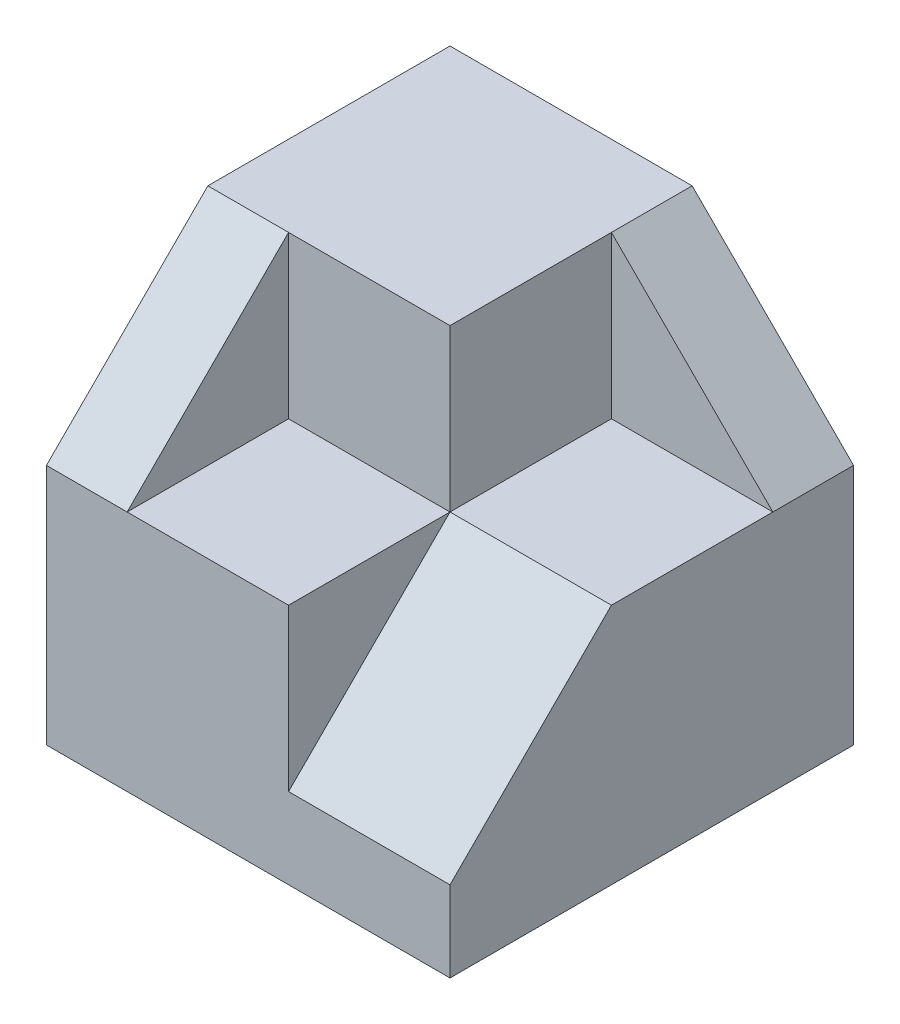
ISO-10303-21;
HEADER;
FILE_DESCRIPTION(('STEP AP214'),'2;1');
FILE_NAME('part.step','',(''),(''),'','','');
FILE_SCHEMA(('AUTOMOTIVE_DESIGN { 1 0 10303 214 1 1 1 1 }'));
ENDSEC;
DATA;
#1=APPLICATION_CONTEXT('core data for automotive mechanical design processes');
#2=APPLICATION_PROTOCOL_DEFINITION('international standard','automotive_design',2000,#1);
#3=PRODUCT_CONTEXT('',#1,'mechanical');
#4=PRODUCT('Part','Part','',(#3));
#5=PRODUCT_RELATED_PRODUCT_CATEGORY('part','',(#4));
#6=PRODUCT_DEFINITION_FORMATION('','',#4);
#7=PRODUCT_DEFINITION_CONTEXT('part definition',#1,'design');
#8=PRODUCT_DEFINITION('design','',#6,#7);
#9=PRODUCT_DEFINITION_SHAPE('','',#8);
#10=(LENGTH_UNIT() NAMED_UNIT(*) SI_UNIT(.MILLI.,.METRE.));
#11=(NAMED_UNIT(*) PLANE_ANGLE_UNIT() SI_UNIT($,.RADIAN.));
#12=(NAMED_UNIT(*) SI_UNIT($,.STERADIAN.) SOLID_ANGLE_UNIT());
#13=UNCERTAINTY_MEASURE_WITH_UNIT(LENGTH_MEASURE(1.E-05),#10,'distance_accuracy_value','');
#14=(GEOMETRIC_REPRESENTATION_CONTEXT(3) GLOBAL_UNCERTAINTY_ASSIGNED_CONTEXT((#13)) GLOBAL_UNIT_ASSIGNED_CONTEXT((#10,
#11,#12)) REPRESENTATION_CONTEXT('',''));
#15=CARTESIAN_POINT('',(0.,0.,0.));
#16=DIRECTION('',(0.,0.,1.));
#17=DIRECTION('',(1.,0.,0.));
#18=AXIS2_PLACEMENT_3D('',#15,#16,#17);
#19=CARTESIAN_POINT('',(0.,0.5,0.));
#20=DIRECTION('',(0.,-1.,0.));
#21=DIRECTION('',(0.,0.,-1.));
#22=AXIS2_PLACEMENT_3D('',#19,#20,#21);
#23=PLANE('',#22);
#24=DIRECTION('',(0.,0.,1.));
#25=VECTOR('',#24,1.);
#26=CARTESIAN_POINT('',(0.5,0.5,1.));
#27=LINE('',#26,#25);
#28=CARTESIAN_POINT('',(0.5,0.5,1.));
#29=VERTEX_POINT('',#28);
#30=CARTESIAN_POINT('',(0.5,0.5,3.));
#31=VERTEX_POINT('',#30);
#32=EDGE_CURVE('E193',#29,#31,#27,.T.);
#33=ORIENTED_EDGE('',*,*,#32,.T.);
#34=DIRECTION('',(1.,0.,0.));
#35=VECTOR('',#34,1.);
#36=CARTESIAN_POINT('',(0.5,0.5,3.));
#37=LINE('',#36,#35);
#38=CARTESIAN_POINT('',(2.5,0.5,3.));
#39=VERTEX_POINT('',#38);
#40=EDGE_CURVE('E176',#31,#39,#37,.T.);
#41=ORIENTED_EDGE('',*,*,#40,.T.);
#42=DIRECTION('',(0.,0.,-1.));
#43=VECTOR('',#42,1.);
#44=CARTESIAN_POINT('',(2.5,0.5,3.));
#45=LINE('',#44,#43);
#46=CARTESIAN_POINT('',(2.5,0.5,1.));
#47=VERTEX_POINT('',#46);
#48=EDGE_CURVE('E204',#39,#47,#45,.T.);
#49=ORIENTED_EDGE('',*,*,#48,.T.);
#50=DIRECTION('',(-1.,0.,0.));
#51=VECTOR('',#50,1.);
#52=CARTESIAN_POINT('',(2.5,0.5,1.));
#53=LINE('',#52,#51);
#54=EDGE_CURVE('E190',#47,#29,#53,.T.);
#55=ORIENTED_EDGE('',*,*,#54,.T.);
#56=EDGE_LOOP('',(#33,#41,#49,#55));
#57=FACE_BOUND('',#56,.T.);
#58=ADVANCED_FACE('F33',(#57),#23,.F.);
#59=CARTESIAN_POINT('',(2.5,-2.5,5.));
#60=DIRECTION('',(-1.,0.,0.));
#61=DIRECTION('',(0.,0.,1.));
#62=AXIS2_PLACEMENT_3D('',#59,#60,#61);
#63=PLANE('',#62);
#64=ORIENTED_EDGE('',*,*,#48,.F.);
#65=DIRECTION('',(0.,0.707106781186548,-0.707106781186548));
#66=VECTOR('',#65,1.);
#67=CARTESIAN_POINT('',(2.5,0.5,3.));
#68=LINE('',#67,#66);
#69=CARTESIAN_POINT('',(2.5,-1.5,5.));
#70=VERTEX_POINT('',#69);
#71=EDGE_CURVE('E170',#70,#39,#68,.T.);
#72=ORIENTED_EDGE('',*,*,#71,.F.);
#73=DIRECTION('',(0.,1.,0.));
#74=VECTOR('',#73,1.);
#75=CARTESIAN_POINT('',(2.5,-2.5,5.));
#76=LINE('',#75,#74);
#77=CARTESIAN_POINT('',(2.5,-2.5,5.));
#78=VERTEX_POINT('',#77);
#79=EDGE_CURVE('E132',#78,#70,#76,.T.);
#80=ORIENTED_EDGE('',*,*,#79,.F.);
#81=DIRECTION('',(0.,0.,-1.));
#82=VECTOR('',#81,1.);
#83=CARTESIAN_POINT('',(2.5,-2.5,5.));
#84=LINE('',#83,#82);
#85=CARTESIAN_POINT('',(2.5,-2.5,0.));
#86=VERTEX_POINT('',#85);
#87=EDGE_CURVE('E134',#78,#86,#84,.T.);
#88=ORIENTED_EDGE('',*,*,#87,.T.);
#89=DIRECTION('',(0.,1.,0.));
#90=VECTOR('',#89,1.);
#91=CARTESIAN_POINT('',(2.5,-2.5,0.));
#92=LINE('',#91,#90);
#93=CARTESIAN_POINT('',(2.5,0.5,0.));
#94=VERTEX_POINT('',#93);
#95=EDGE_CURVE('E141',#86,#94,#92,.T.);
#96=ORIENTED_EDGE('',*,*,#95,.T.);
#97=DIRECTION('',(0.,0.,1.));
#98=VECTOR('',#97,1.);
#99=CARTESIAN_POINT('',(2.5,0.5,0.));
#100=LINE('',#99,#98);
#101=EDGE_CURVE('E166',#94,#47,#100,.T.);
#102=ORIENTED_EDGE('',*,*,#101,.T.);
#103=EDGE_LOOP('',(#64,#72,#80,#88,#96,#102));
#104=FACE_BOUND('',#103,.T.);
#105=ADVANCED_FACE('F35',(#104),#63,.F.);
#106=CARTESIAN_POINT('',(-2.5,2.5,5.));
#107=DIRECTION('',(0.,-1.,0.));
#108=DIRECTION('',(0.,0.,-1.));
#109=AXIS2_PLACEMENT_3D('',#106,#107,#108);
#110=PLANE('',#109);
#111=DIRECTION('',(0.,0.,-1.));
#112=VECTOR('',#111,1.);
#113=CARTESIAN_POINT('',(-2.5,2.5,5.));
#114=LINE('',#113,#112);
#115=CARTESIAN_POINT('',(-2.5,2.5,3.));
#116=VERTEX_POINT('',#115);
#117=CARTESIAN_POINT('',(-2.5,2.5,0.));
#118=VERTEX_POINT('',#117);
#119=EDGE_CURVE('E11',#116,#118,#114,.T.);
#120=ORIENTED_EDGE('',*,*,#119,.F.);
#121=DIRECTION('',(1.,0.,0.));
#122=VECTOR('',#121,1.);
#123=CARTESIAN_POINT('',(-2.5,2.5,3.));
#124=LINE('',#123,#122);
#125=CARTESIAN_POINT('',(-1.5,2.5,3.));
#126=VERTEX_POINT('',#125);
#127=EDGE_CURVE('E113',#116,#126,#124,.T.);
#128=ORIENTED_EDGE('',*,*,#127,.T.);
#129=DIRECTION('',(-1.,0.,0.));
#130=VECTOR('',#129,1.);
#131=CARTESIAN_POINT('',(-1.5,2.5,3.));
#132=LINE('',#131,#130);
#133=CARTESIAN_POINT('',(0.5,2.5,3.));
#134=VERTEX_POINT('',#133);
#135=EDGE_CURVE('E201',#134,#126,#132,.T.);
#136=ORIENTED_EDGE('',*,*,#135,.F.);
#137=DIRECTION('',(0.,0.,1.));
#138=VECTOR('',#137,1.);
#139=CARTESIAN_POINT('',(0.5,2.5,1.));
#140=LINE('',#139,#138);
#141=CARTESIAN_POINT('',(0.5,2.5,1.));
#142=VERTEX_POINT('',#141);
#143=EDGE_CURVE('E188',#142,#134,#140,.T.);
#144=ORIENTED_EDGE('',*,*,#143,.F.);
#145=DIRECTION('',(0.,0.,1.));
#146=VECTOR('',#145,1.);
#147=CARTESIAN_POINT('',(0.5,2.5,0.));
#148=LINE('',#147,#146);
#149=CARTESIAN_POINT('',(0.5,2.5,0.));
#150=VERTEX_POINT('',#149);
#151=EDGE_CURVE('E185',#150,#142,#148,.T.);
#152=ORIENTED_EDGE('',*,*,#151,.F.);
#153=DIRECTION('',(-1.,0.,0.));
#154=VECTOR('',#153,1.);
#155=CARTESIAN_POINT('',(-2.5,2.5,0.));
#156=LINE('',#155,#154);
#157=EDGE_CURVE('E144',#150,#118,#156,.T.);
#158=ORIENTED_EDGE('',*,*,#157,.T.);
#159=EDGE_LOOP('',(#120,#128,#136,#144,#152,#158));
#160=FACE_BOUND('',#159,.T.);
#161=ADVANCED_FACE('F225',(#160),#110,.F.);
#162=CARTESIAN_POINT('',(-2.5,-2.5,5.));
#163=DIRECTION('',(1.,0.,0.));
#164=DIRECTION('',(0.,0.,-1.));
#165=AXIS2_PLACEMENT_3D('',#162,#163,#164);
#166=PLANE('',#165);
#167=DIRECTION('',(0.,-1.,0.));
#168=VECTOR('',#167,1.);
#169=CARTESIAN_POINT('',(-2.5,-2.5,5.));
#170=LINE('',#169,#168);
#171=CARTESIAN_POINT('',(-2.5,0.5,5.));
#172=VERTEX_POINT('',#171);
#173=CARTESIAN_POINT('',(-2.5,-2.5,5.));
#174=VERTEX_POINT('',#173);
#175=EDGE_CURVE('E122',#172,#174,#170,.T.);
#176=ORIENTED_EDGE('',*,*,#175,.F.);
#177=DIRECTION('',(0.,0.707106781186548,-0.707106781186548));
#178=VECTOR('',#177,1.);
#179=CARTESIAN_POINT('',(-2.5,2.5,3.));
#180=LINE('',#179,#178);
#181=EDGE_CURVE('E110',#172,#116,#180,.T.);
#182=ORIENTED_EDGE('',*,*,#181,.T.);
#183=ORIENTED_EDGE('',*,*,#119,.T.);
#184=DIRECTION('',(0.,-1.,0.));
#185=VECTOR('',#184,1.);
#186=CARTESIAN_POINT('',(-2.5,-2.5,0.));
#187=LINE('',#186,#185);
#188=CARTESIAN_POINT('',(-2.5,-2.5,0.));
#189=VERTEX_POINT('',#188);
#190=EDGE_CURVE('E148',#118,#189,#187,.T.);
#191=ORIENTED_EDGE('',*,*,#190,.T.);
#192=DIRECTION('',(0.,0.,-1.));
#193=VECTOR('',#192,1.);
#194=CARTESIAN_POINT('',(-2.5,-2.5,5.));
#195=LINE('',#194,#193);
#196=EDGE_CURVE('E41',#174,#189,#195,.T.);
#197=ORIENTED_EDGE('',*,*,#196,.F.);
#198=EDGE_LOOP('',(#176,#182,#183,#191,#197));
#199=FACE_BOUND('',#198,.T.);
#200=ADVANCED_FACE('F128',(#199),#166,.F.);
#201=CARTESIAN_POINT('',(-2.5,-2.5,5.));
#202=DIRECTION('',(0.,1.,0.));
#203=DIRECTION('',(0.,0.,1.));
#204=AXIS2_PLACEMENT_3D('',#201,#202,#203);
#205=PLANE('',#204);
#206=DIRECTION('',(1.,0.,0.));
#207=VECTOR('',#206,1.);
#208=CARTESIAN_POINT('',(-2.5,-2.5,0.));
#209=LINE('',#208,#207);
#210=EDGE_CURVE('E137',#189,#86,#209,.T.);
#211=ORIENTED_EDGE('',*,*,#210,.T.);
#212=ORIENTED_EDGE('',*,*,#87,.F.);
#213=DIRECTION('',(1.,0.,0.));
#214=VECTOR('',#213,1.);
#215=CARTESIAN_POINT('',(-2.5,-2.5,5.));
#216=LINE('',#215,#214);
#217=EDGE_CURVE('E131',#174,#78,#216,.T.);
#218=ORIENTED_EDGE('',*,*,#217,.F.);
#219=ORIENTED_EDGE('',*,*,#196,.T.);
#220=EDGE_LOOP('',(#211,#212,#218,#219));
#221=FACE_BOUND('',#220,.T.);
#222=ADVANCED_FACE('F154',(#221),#205,.F.);
#223=CARTESIAN_POINT('',(0.,0.,5.));
#224=DIRECTION('',(0.,0.,-1.));
#225=DIRECTION('',(-1.,0.,0.));
#226=AXIS2_PLACEMENT_3D('',#223,#224,#225);
#227=PLANE('',#226);
#228=DIRECTION('',(1.,0.,0.));
#229=VECTOR('',#228,1.);
#230=CARTESIAN_POINT('',(2.5,0.5,5.));
#231=LINE('',#230,#229);
#232=CARTESIAN_POINT('',(-1.5,0.5,5.));
#233=VERTEX_POINT('',#232);
#234=CARTESIAN_POINT('',(0.5,0.5,5.));
#235=VERTEX_POINT('',#234);
#236=EDGE_CURVE('E126',#233,#235,#231,.T.);
#237=ORIENTED_EDGE('',*,*,#236,.F.);
#238=DIRECTION('',(1.,0.,0.));
#239=VECTOR('',#238,1.);
#240=CARTESIAN_POINT('',(-2.5,0.5,5.));
#241=LINE('',#240,#239);
#242=EDGE_CURVE('E56',#172,#233,#241,.T.);
#243=ORIENTED_EDGE('',*,*,#242,.F.);
#244=ORIENTED_EDGE('',*,*,#175,.T.);
#245=ORIENTED_EDGE('',*,*,#217,.T.);
#246=ORIENTED_EDGE('',*,*,#79,.T.);
#247=DIRECTION('',(1.,0.,0.));
#248=VECTOR('',#247,1.);
#249=CARTESIAN_POINT('',(0.5,-1.5,5.));
#250=LINE('',#249,#248);
#251=CARTESIAN_POINT('',(0.5,-1.5,5.));
#252=VERTEX_POINT('',#251);
#253=EDGE_CURVE('E172',#252,#70,#250,.T.);
#254=ORIENTED_EDGE('',*,*,#253,.F.);
#255=DIRECTION('',(0.,-1.,0.));
#256=VECTOR('',#255,1.);
#257=CARTESIAN_POINT('',(0.5,-1.5,5.));
#258=LINE('',#257,#256);
#259=EDGE_CURVE('E173',#235,#252,#258,.T.);
#260=ORIENTED_EDGE('',*,*,#259,.F.);
#261=EDGE_LOOP('',(#237,#243,#244,#245,#246,#254,#260));
#262=FACE_BOUND('',#261,.T.);
#263=ADVANCED_FACE('F121',(#262),#227,.F.);
#264=CARTESIAN_POINT('',(0.,0.,0.));
#265=DIRECTION('',(0.,0.,-1.));
#266=DIRECTION('',(-1.,0.,0.));
#267=AXIS2_PLACEMENT_3D('',#264,#265,#266);
#268=PLANE('',#267);
#269=DIRECTION('',(0.707106781186548,-0.707106781186548,0.));
#270=VECTOR('',#269,1.);
#271=CARTESIAN_POINT('',(0.5,2.5,0.));
#272=LINE('',#271,#270);
#273=EDGE_CURVE('E162',#150,#94,#272,.T.);
#274=ORIENTED_EDGE('',*,*,#273,.T.);
#275=ORIENTED_EDGE('',*,*,#95,.F.);
#276=ORIENTED_EDGE('',*,*,#210,.F.);
#277=ORIENTED_EDGE('',*,*,#190,.F.);
#278=ORIENTED_EDGE('',*,*,#157,.F.);
#279=EDGE_LOOP('',(#274,#275,#276,#277,#278));
#280=FACE_BOUND('',#279,.T.);
#281=ADVANCED_FACE('F160',(#280),#268,.T.);
#282=CARTESIAN_POINT('',(-1.5,0.5,5.));
#283=DIRECTION('',(-1.,0.,0.));
#284=DIRECTION('',(0.,0.,1.));
#285=AXIS2_PLACEMENT_3D('',#282,#283,#284);
#286=PLANE('',#285);
#287=DIRECTION('',(0.,1.,0.));
#288=VECTOR('',#287,1.);
#289=CARTESIAN_POINT('',(-1.5,0.5,3.));
#290=LINE('',#289,#288);
#291=CARTESIAN_POINT('',(-1.5,0.5,3.));
#292=VERTEX_POINT('',#291);
#293=EDGE_CURVE('E145',#292,#126,#290,.T.);
#294=ORIENTED_EDGE('',*,*,#293,.T.);
#295=DIRECTION('',(0.,0.707106781186548,-0.707106781186548));
#296=VECTOR('',#295,1.);
#297=CARTESIAN_POINT('',(-1.5,2.5,3.));
#298=LINE('',#297,#296);
#299=EDGE_CURVE('E117',#233,#126,#298,.T.);
#300=ORIENTED_EDGE('',*,*,#299,.F.);
#301=DIRECTION('',(0.,0.,1.));
#302=VECTOR('',#301,1.);
#303=CARTESIAN_POINT('',(-1.5,0.5,5.));
#304=LINE('',#303,#302);
#305=EDGE_CURVE('E208',#292,#233,#304,.T.);
#306=ORIENTED_EDGE('',*,*,#305,.F.);
#307=EDGE_LOOP('',(#294,#300,#306));
#308=FACE_BOUND('',#307,.T.);
#309=ADVANCED_FACE('F217',(#308),#286,.F.);
#310=CARTESIAN_POINT('',(-1.5,0.5,3.));
#311=DIRECTION('',(0.,0.,-1.));
#312=DIRECTION('',(-1.,0.,0.));
#313=AXIS2_PLACEMENT_3D('',#310,#311,#312);
#314=PLANE('',#313);
#315=DIRECTION('',(-1.,0.,0.));
#316=VECTOR('',#315,1.);
#317=CARTESIAN_POINT('',(-1.5,0.5,3.));
#318=LINE('',#317,#316);
#319=EDGE_CURVE('E206',#31,#292,#318,.T.);
#320=ORIENTED_EDGE('',*,*,#319,.F.);
#321=DIRECTION('',(0.,1.,0.));
#322=VECTOR('',#321,1.);
#323=CARTESIAN_POINT('',(0.5,0.5,3.));
#324=LINE('',#323,#322);
#325=EDGE_CURVE('E198',#31,#134,#324,.T.);
#326=ORIENTED_EDGE('',*,*,#325,.T.);
#327=ORIENTED_EDGE('',*,*,#135,.T.);
#328=ORIENTED_EDGE('',*,*,#293,.F.);
#329=EDGE_LOOP('',(#320,#326,#327,#328));
#330=FACE_BOUND('',#329,.T.);
#331=ADVANCED_FACE('F220',(#330),#314,.F.);
#332=ORIENTED_EDGE('',*,*,#236,.T.);
#333=DIRECTION('',(0.,0.,1.));
#334=VECTOR('',#333,1.);
#335=CARTESIAN_POINT('',(0.5,0.5,5.));
#336=LINE('',#335,#334);
#337=EDGE_CURVE('E231',#31,#235,#336,.T.);
#338=ORIENTED_EDGE('',*,*,#337,.F.);
#339=ORIENTED_EDGE('',*,*,#319,.T.);
#340=ORIENTED_EDGE('',*,*,#305,.T.);
#341=EDGE_LOOP('',(#332,#338,#339,#340));
#342=FACE_BOUND('',#341,.T.);
#343=ADVANCED_FACE('F235',(#342),#23,.F.);
#344=CARTESIAN_POINT('',(0.5,0.5,1.));
#345=DIRECTION('',(-1.,0.,0.));
#346=DIRECTION('',(0.,0.,1.));
#347=AXIS2_PLACEMENT_3D('',#344,#345,#346);
#348=PLANE('',#347);
#349=ORIENTED_EDGE('',*,*,#143,.T.);
#350=ORIENTED_EDGE('',*,*,#325,.F.);
#351=ORIENTED_EDGE('',*,*,#32,.F.);
#352=DIRECTION('',(0.,1.,0.));
#353=VECTOR('',#352,1.);
#354=CARTESIAN_POINT('',(0.5,0.5,1.));
#355=LINE('',#354,#353);
#356=EDGE_CURVE('E196',#29,#142,#355,.T.);
#357=ORIENTED_EDGE('',*,*,#356,.T.);
#358=EDGE_LOOP('',(#349,#350,#351,#357));
#359=FACE_BOUND('',#358,.T.);
#360=ADVANCED_FACE('F239',(#359),#348,.F.);
#361=CARTESIAN_POINT('',(2.5,0.5,1.));
#362=DIRECTION('',(0.,0.,-1.));
#363=DIRECTION('',(-1.,0.,0.));
#364=AXIS2_PLACEMENT_3D('',#361,#362,#363);
#365=PLANE('',#364);
#366=ORIENTED_EDGE('',*,*,#54,.F.);
#367=DIRECTION('',(0.707106781186548,-0.707106781186548,0.));
#368=VECTOR('',#367,1.);
#369=CARTESIAN_POINT('',(0.5,2.5,1.));
#370=LINE('',#369,#368);
#371=EDGE_CURVE('E175',#142,#47,#370,.T.);
#372=ORIENTED_EDGE('',*,*,#371,.F.);
#373=ORIENTED_EDGE('',*,*,#356,.F.);
#374=EDGE_LOOP('',(#366,#372,#373));
#375=FACE_BOUND('',#374,.T.);
#376=ADVANCED_FACE('F242',(#375),#365,.F.);
#377=CARTESIAN_POINT('',(0.5,2.5,0.));
#378=DIRECTION('',(-0.707106781186548,-0.707106781186548,0.));
#379=DIRECTION('',(0.707106781186547,-0.707106781186548,0.));
#380=AXIS2_PLACEMENT_3D('',#377,#378,#379);
#381=PLANE('',#380);
#382=ORIENTED_EDGE('',*,*,#371,.T.);
#383=ORIENTED_EDGE('',*,*,#101,.F.);
#384=ORIENTED_EDGE('',*,*,#273,.F.);
#385=ORIENTED_EDGE('',*,*,#151,.T.);
#386=EDGE_LOOP('',(#382,#383,#384,#385));
#387=FACE_BOUND('',#386,.T.);
#388=ADVANCED_FACE('F244',(#387),#381,.F.);
#389=CARTESIAN_POINT('',(0.5,0.5,3.));
#390=DIRECTION('',(0.,-0.707106781186547,-0.707106781186547));
#391=DIRECTION('',(0.,0.707106781186548,-0.707106781186548));
#392=AXIS2_PLACEMENT_3D('',#389,#390,#391);
#393=PLANE('',#392);
#394=ORIENTED_EDGE('',*,*,#71,.T.);
#395=ORIENTED_EDGE('',*,*,#40,.F.);
#396=DIRECTION('',(0.,0.707106781186548,-0.707106781186548));
#397=VECTOR('',#396,1.);
#398=CARTESIAN_POINT('',(0.5,0.5,3.));
#399=LINE('',#398,#397);
#400=EDGE_CURVE('E48',#252,#31,#399,.T.);
#401=ORIENTED_EDGE('',*,*,#400,.F.);
#402=ORIENTED_EDGE('',*,*,#253,.T.);
#403=EDGE_LOOP('',(#394,#395,#401,#402));
#404=FACE_BOUND('',#403,.T.);
#405=ADVANCED_FACE('F246',(#404),#393,.F.);
#406=CARTESIAN_POINT('',(0.5,0.,0.));
#407=DIRECTION('',(-1.,0.,0.));
#408=DIRECTION('',(0.,0.,1.));
#409=AXIS2_PLACEMENT_3D('',#406,#407,#408);
#410=PLANE('',#409);
#411=ORIENTED_EDGE('',*,*,#400,.T.);
#412=ORIENTED_EDGE('',*,*,#337,.T.);
#413=ORIENTED_EDGE('',*,*,#259,.T.);
#414=EDGE_LOOP('',(#411,#412,#413));
#415=FACE_BOUND('',#414,.T.);
#416=ADVANCED_FACE('F232',(#415),#410,.F.);
#417=CARTESIAN_POINT('',(-2.5,2.5,3.));
#418=DIRECTION('',(0.,-0.707106781186547,-0.707106781186547));
#419=DIRECTION('',(0.,0.707106781186548,-0.707106781186548));
#420=AXIS2_PLACEMENT_3D('',#417,#418,#419);
#421=PLANE('',#420);
#422=ORIENTED_EDGE('',*,*,#299,.T.);
#423=ORIENTED_EDGE('',*,*,#127,.F.);
#424=ORIENTED_EDGE('',*,*,#181,.F.);
#425=ORIENTED_EDGE('',*,*,#242,.T.);
#426=EDGE_LOOP('',(#422,#423,#424,#425));
#427=FACE_BOUND('',#426,.T.);
#428=ADVANCED_FACE('F111',(#427),#421,.F.);
#429=CLOSED_SHELL('',(#58,#105,#161,#200,#222,#263,#281,#309,#331,#343,#360,#376,#388,#405,#416,#428));
#430=MANIFOLD_SOLID_BREP('B2',#429);
#431=ADVANCED_BREP_SHAPE_REPRESENTATION('',(#18,#430),#14);
#432=SHAPE_DEFINITION_REPRESENTATION(#9,#431);
ENDSEC;
END-ISO-10303-21;
